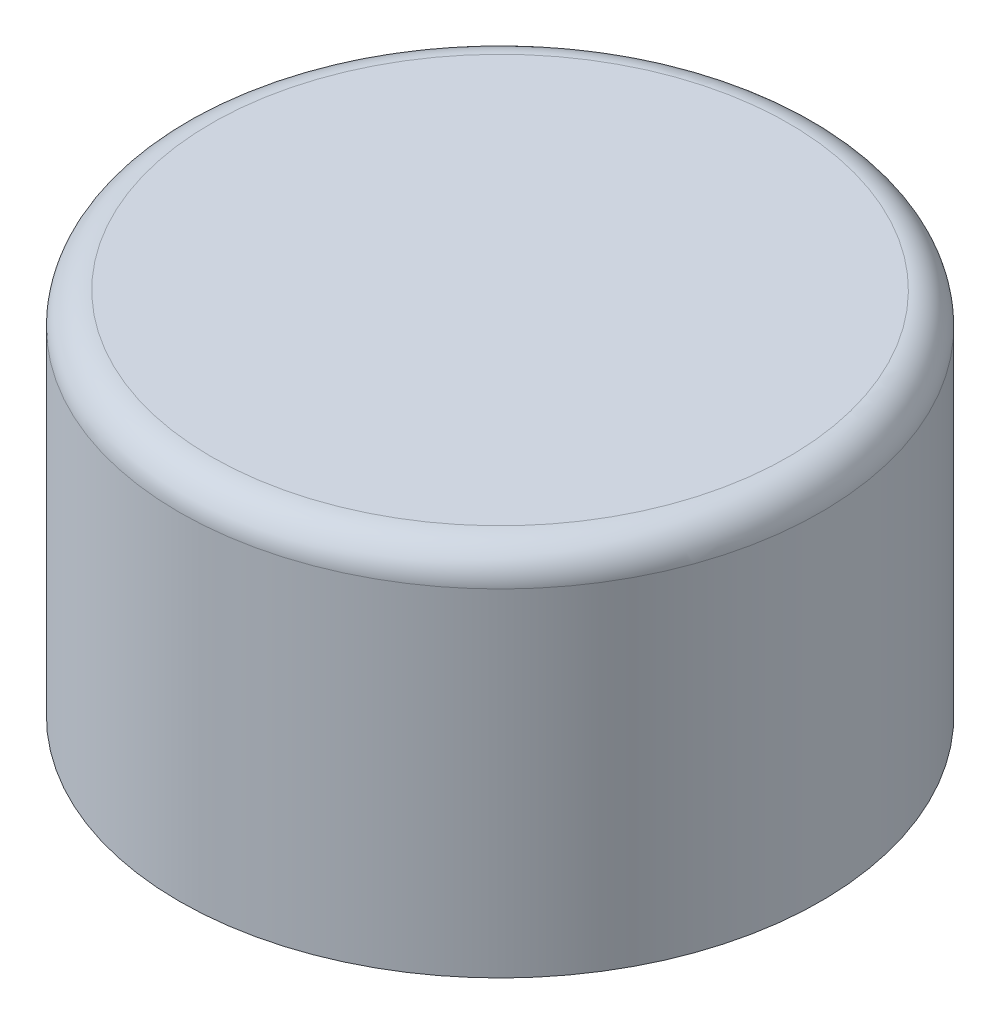
ISO-10303-21;
HEADER;
FILE_DESCRIPTION(('STEP AP214'),'2;1');
FILE_NAME('part.step','',(''),(''),'','','');
FILE_SCHEMA(('AUTOMOTIVE_DESIGN { 1 0 10303 214 1 1 1 1 }'));
ENDSEC;
DATA;
#1=APPLICATION_CONTEXT('core data for automotive mechanical design processes');
#2=APPLICATION_PROTOCOL_DEFINITION('international standard','automotive_design',2000,#1);
#3=PRODUCT_CONTEXT('',#1,'mechanical');
#4=PRODUCT('Part','Part','',(#3));
#5=PRODUCT_RELATED_PRODUCT_CATEGORY('part','',(#4));
#6=PRODUCT_DEFINITION_FORMATION('','',#4);
#7=PRODUCT_DEFINITION_CONTEXT('part definition',#1,'design');
#8=PRODUCT_DEFINITION('design','',#6,#7);
#9=PRODUCT_DEFINITION_SHAPE('','',#8);
#10=(LENGTH_UNIT() NAMED_UNIT(*) SI_UNIT(.MILLI.,.METRE.));
#11=(NAMED_UNIT(*) PLANE_ANGLE_UNIT() SI_UNIT($,.RADIAN.));
#12=(NAMED_UNIT(*) SI_UNIT($,.STERADIAN.) SOLID_ANGLE_UNIT());
#13=UNCERTAINTY_MEASURE_WITH_UNIT(LENGTH_MEASURE(1.E-05),#10,'distance_accuracy_value','');
#14=(GEOMETRIC_REPRESENTATION_CONTEXT(3) GLOBAL_UNCERTAINTY_ASSIGNED_CONTEXT((#13)) GLOBAL_UNIT_ASSIGNED_CONTEXT((#10,
#11,#12)) REPRESENTATION_CONTEXT('',''));
#15=CARTESIAN_POINT('',(0.,0.,0.));
#16=DIRECTION('',(0.,0.,1.));
#17=DIRECTION('',(1.,0.,0.));
#18=AXIS2_PLACEMENT_3D('',#15,#16,#17);
#19=CARTESIAN_POINT('',(0.,0.,0.));
#20=DIRECTION('',(0.,1.,0.));
#21=DIRECTION('',(0.,0.,1.));
#22=AXIS2_PLACEMENT_3D('',#19,#20,#21);
#23=PLANE('',#22);
#24=CARTESIAN_POINT('',(0.,0.,0.));
#25=DIRECTION('',(0.,1.,0.));
#26=DIRECTION('',(0.,0.,1.));
#27=AXIS2_PLACEMENT_3D('',#24,#25,#26);
#28=CIRCLE('',#27,50.8);
#29=CARTESIAN_POINT('',(0.,0.,50.8));
#30=VERTEX_POINT('',#29);
#31=EDGE_CURVE('E53',#30,#30,#28,.T.);
#32=ORIENTED_EDGE('',*,*,#31,.F.);
#33=EDGE_LOOP('',(#32));
#34=FACE_BOUND('',#33,.T.);
#35=CARTESIAN_POINT('',(0.,0.,0.));
#36=DIRECTION('',(0.,1.,0.));
#37=DIRECTION('',(0.,0.,1.));
#38=AXIS2_PLACEMENT_3D('',#35,#36,#37);
#39=CIRCLE('',#38,44.45);
#40=CARTESIAN_POINT('',(0.,0.,44.45));
#41=VERTEX_POINT('',#40);
#42=EDGE_CURVE('E58',#41,#41,#39,.T.);
#43=ORIENTED_EDGE('',*,*,#42,.T.);
#44=EDGE_LOOP('',(#43));
#45=FACE_BOUND('',#44,.T.);
#46=ADVANCED_FACE('F40',(#34,#45),#23,.F.);
#47=CARTESIAN_POINT('',(0.,50.8,0.));
#48=DIRECTION('',(0.,-1.,0.));
#49=DIRECTION('',(0.,0.,-1.));
#50=AXIS2_PLACEMENT_3D('',#47,#48,#49);
#51=CYLINDRICAL_SURFACE('',#50,50.8);
#52=CARTESIAN_POINT('',(0.,53.34,0.));
#53=DIRECTION('',(0.,1.,0.));
#54=DIRECTION('',(0.,0.,1.));
#55=AXIS2_PLACEMENT_3D('',#52,#53,#54);
#56=CIRCLE('',#55,50.8);
#57=CARTESIAN_POINT('',(0.,53.34,50.8));
#58=VERTEX_POINT('',#57);
#59=EDGE_CURVE('E10',#58,#58,#56,.F.);
#60=ORIENTED_EDGE('',*,*,#59,.T.);
#61=EDGE_LOOP('',(#60));
#62=FACE_BOUND('',#61,.T.);
#63=ORIENTED_EDGE('',*,*,#31,.T.);
#64=EDGE_LOOP('',(#63));
#65=FACE_BOUND('',#64,.T.);
#66=ADVANCED_FACE('F81',(#62,#65),#51,.T.);
#67=CARTESIAN_POINT('',(0.,50.8,0.));
#68=DIRECTION('',(0.,-1.,0.));
#69=DIRECTION('',(0.,0.,-1.));
#70=AXIS2_PLACEMENT_3D('',#67,#68,#69);
#71=CYLINDRICAL_SURFACE('',#70,44.45);
#72=CARTESIAN_POINT('',(0.,50.8,0.));
#73=DIRECTION('',(0.,1.,0.));
#74=DIRECTION('',(0.,0.,1.));
#75=AXIS2_PLACEMENT_3D('',#72,#73,#74);
#76=CIRCLE('',#75,44.45);
#77=CARTESIAN_POINT('',(0.,50.8,44.45));
#78=VERTEX_POINT('',#77);
#79=EDGE_CURVE('E64',#78,#78,#76,.T.);
#80=ORIENTED_EDGE('',*,*,#79,.T.);
#81=EDGE_LOOP('',(#80));
#82=FACE_BOUND('',#81,.T.);
#83=ORIENTED_EDGE('',*,*,#42,.F.);
#84=EDGE_LOOP('',(#83));
#85=FACE_BOUND('',#84,.T.);
#86=ADVANCED_FACE('F69',(#82,#85),#71,.F.);
#87=CARTESIAN_POINT('',(0.,50.8,0.));
#88=DIRECTION('',(0.,1.,0.));
#89=DIRECTION('',(0.,0.,1.));
#90=AXIS2_PLACEMENT_3D('',#87,#88,#89);
#91=PLANE('',#90);
#92=ORIENTED_EDGE('',*,*,#79,.F.);
#93=EDGE_LOOP('',(#92));
#94=FACE_BOUND('',#93,.T.);
#95=ADVANCED_FACE('F72',(#94),#91,.F.);
#96=CARTESIAN_POINT('',(0.,58.42,0.));
#97=DIRECTION('',(0.,1.,0.));
#98=DIRECTION('',(0.,0.,1.));
#99=AXIS2_PLACEMENT_3D('',#96,#97,#98);
#100=PLANE('',#99);
#101=CARTESIAN_POINT('',(0.,58.42,0.));
#102=DIRECTION('',(0.,1.,0.));
#103=DIRECTION('',(0.,0.,1.));
#104=AXIS2_PLACEMENT_3D('',#101,#102,#103);
#105=CIRCLE('',#104,45.72);
#106=CARTESIAN_POINT('',(0.,58.42,45.72));
#107=VERTEX_POINT('',#106);
#108=EDGE_CURVE('E48',#107,#107,#105,.T.);
#109=ORIENTED_EDGE('',*,*,#108,.T.);
#110=EDGE_LOOP('',(#109));
#111=FACE_BOUND('',#110,.T.);
#112=ADVANCED_FACE('F74',(#111),#100,.T.);
#113=CARTESIAN_POINT('',(0.,53.34,0.));
#114=DIRECTION('',(0.,1.,0.));
#115=DIRECTION('',(0.,0.,1.));
#116=AXIS2_PLACEMENT_3D('',#113,#114,#115);
#117=TOROIDAL_SURFACE('',#116,45.72,5.08);
#118=ORIENTED_EDGE('',*,*,#59,.F.);
#119=EDGE_LOOP('',(#118));
#120=FACE_BOUND('',#119,.T.);
#121=ORIENTED_EDGE('',*,*,#108,.F.);
#122=EDGE_LOOP('',(#121));
#123=FACE_BOUND('',#122,.T.);
#124=ADVANCED_FACE('F42',(#120,#123),#117,.T.);
#125=CLOSED_SHELL('',(#46,#66,#86,#95,#112,#124));
#126=MANIFOLD_SOLID_BREP('B2',#125);
#127=ADVANCED_BREP_SHAPE_REPRESENTATION('',(#18,#126),#14);
#128=SHAPE_DEFINITION_REPRESENTATION(#9,#127);
ENDSEC;
END-ISO-10303-21;
